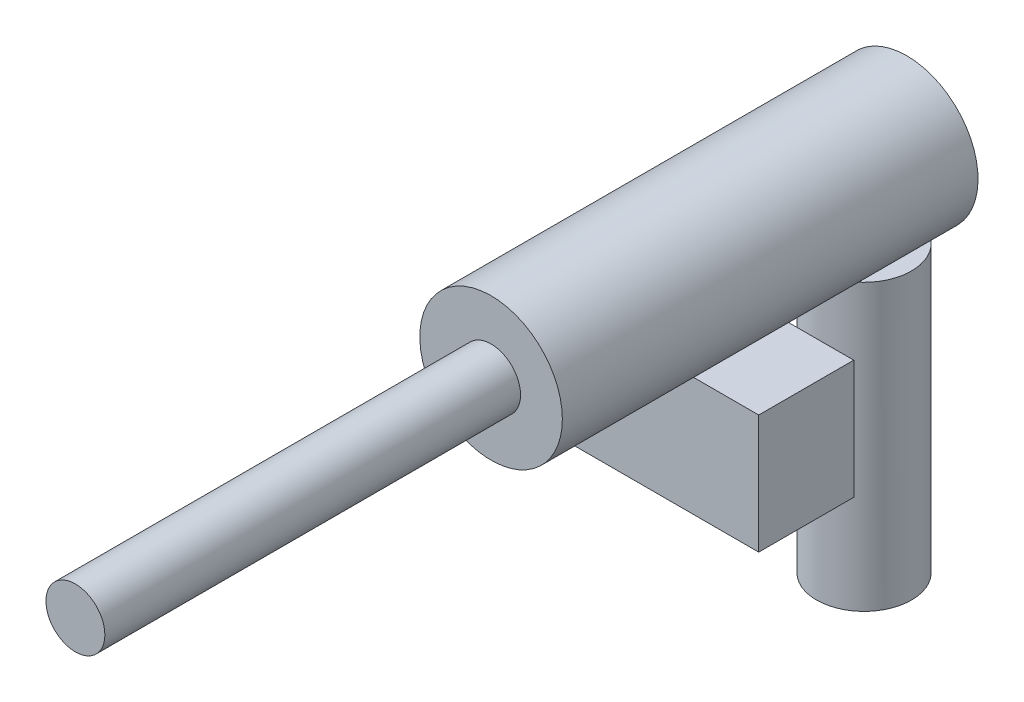
ISO-10303-21;
HEADER;
FILE_DESCRIPTION(('STEP AP214'),'2;1');
FILE_NAME('part.step','',(''),(''),'','','');
FILE_SCHEMA(('AUTOMOTIVE_DESIGN { 1 0 10303 214 1 1 1 1 }'));
ENDSEC;
DATA;
#1=APPLICATION_CONTEXT('core data for automotive mechanical design processes');
#2=APPLICATION_PROTOCOL_DEFINITION('international standard','automotive_design',2000,#1);
#3=PRODUCT_CONTEXT('',#1,'mechanical');
#4=PRODUCT('Part','Part','',(#3));
#5=PRODUCT_RELATED_PRODUCT_CATEGORY('part','',(#4));
#6=PRODUCT_DEFINITION_FORMATION('','',#4);
#7=PRODUCT_DEFINITION_CONTEXT('part definition',#1,'design');
#8=PRODUCT_DEFINITION('design','',#6,#7);
#9=PRODUCT_DEFINITION_SHAPE('','',#8);
#10=(LENGTH_UNIT() NAMED_UNIT(*) SI_UNIT(.MILLI.,.METRE.));
#11=(NAMED_UNIT(*) PLANE_ANGLE_UNIT() SI_UNIT($,.RADIAN.));
#12=(NAMED_UNIT(*) SI_UNIT($,.STERADIAN.) SOLID_ANGLE_UNIT());
#13=UNCERTAINTY_MEASURE_WITH_UNIT(LENGTH_MEASURE(1.E-05),#10,'distance_accuracy_value','');
#14=(GEOMETRIC_REPRESENTATION_CONTEXT(3) GLOBAL_UNCERTAINTY_ASSIGNED_CONTEXT((#13)) GLOBAL_UNIT_ASSIGNED_CONTEXT((#10,
#11,#12)) REPRESENTATION_CONTEXT('',''));
#15=CARTESIAN_POINT('',(0.,0.,0.));
#16=DIRECTION('',(0.,0.,1.));
#17=DIRECTION('',(1.,0.,0.));
#18=AXIS2_PLACEMENT_3D('',#15,#16,#17);
#19=CARTESIAN_POINT('',(0.,120.,17.9882332348629));
#20=DIRECTION('',(0.,-1.,0.));
#21=DIRECTION('',(0.,0.,-1.));
#22=AXIS2_PLACEMENT_3D('',#19,#20,#21);
#23=CYLINDRICAL_SURFACE('',#22,20.);
#24=CARTESIAN_POINT('',(0.,0.,17.9882332348629));
#25=DIRECTION('',(0.,1.,0.));
#26=DIRECTION('',(0.,0.,1.));
#27=AXIS2_PLACEMENT_3D('',#24,#25,#26);
#28=CIRCLE('',#27,20.);
#29=CARTESIAN_POINT('',(0.,0.,37.9882332348629));
#30=VERTEX_POINT('',#29);
#31=EDGE_CURVE('E10',#30,#30,#28,.T.);
#32=ORIENTED_EDGE('',*,*,#31,.T.);
#33=EDGE_LOOP('',(#32));
#34=FACE_BOUND('',#33,.T.);
#35=CARTESIAN_POINT('',(-5.52136853570222,120.,37.2109929090865));
#36=CARTESIAN_POINT('',(-5.29193302138806,119.957037804867,37.2768943103946));
#37=CARTESIAN_POINT('',(-5.06091253678999,119.916554845313,37.3388024333484));
#38=CARTESIAN_POINT('',(-4.59598902122755,119.840737590571,37.45446777266));
#39=CARTESIAN_POINT('',(-4.36208580677417,119.805403624977,37.5082244672428));
#40=CARTESIAN_POINT('',(-3.65650935186531,119.70741580209,37.657012798175));
#41=CARTESIAN_POINT('',(-3.18098714133818,119.652779380687,37.7395575443784));
#42=CARTESIAN_POINT('',(-2.23648701823114,119.567357095238,37.8683503241664));
#43=CARTESIAN_POINT('',(-1.76769162302288,119.535953618657,37.9155387256518));
#44=CARTESIAN_POINT('',(-0.827057573782939,119.495240836377,37.9766799810276));
#45=CARTESIAN_POINT('',(-0.35521962391118,119.485926590303,37.9906402665686));
#46=CARTESIAN_POINT('',(0.569300120255659,119.489514564927,37.9852577339645));
#47=CARTESIAN_POINT('',(1.02199373849562,119.501543628949,37.9672238052882));
#48=CARTESIAN_POINT('',(1.92417509509113,119.545894783714,37.9005962290482));
#49=CARTESIAN_POINT('',(2.37366234055381,119.578219929223,37.8519979812444));
#50=CARTESIAN_POINT('',(3.27874165463818,119.663681644793,37.7230855988506));
#51=CARTESIAN_POINT('',(3.73416545758763,119.717362201779,37.641941952275));
#52=CARTESIAN_POINT('',(4.41014591507066,119.812584102018,37.4973022562262));
#53=CARTESIAN_POINT('',(4.63428007047812,119.8467748898,37.44526835514));
#54=CARTESIAN_POINT('',(5.0798849802044,119.919884182736,37.3337108859222));
#55=CARTESIAN_POINT('',(5.30135588304188,119.958802422903,37.2741877375769));
#56=CARTESIAN_POINT('',(5.52136853570222,120.,37.2109929090865));
#57=B_SPLINE_CURVE_WITH_KNOTS('',3,(#35,#36,#37,#38,#39,#40,#41,#42,#43,#44,#45,#46,#47,#48,#49,
#50,#51,#52,#53,#54,#55,#56),.UNSPECIFIED.,.F.,.F.,(4,2,2,2,2,2,2,2,2,2,4),(0.,
0.727539342602545,1.45512523556238,2.91035344813137,4.32535051133286,5.74003107292183,
7.09816389103249,8.45650117084997,9.85191582673057,10.5496223790287,11.2472898409632),.UNSPECIFIED.);
#58=CARTESIAN_POINT('',(-5.52136853570222,120.,37.2109929090865));
#59=VERTEX_POINT('',#58);
#60=CARTESIAN_POINT('',(5.52136853570222,120.,37.2109929090865));
#61=VERTEX_POINT('',#60);
#62=EDGE_CURVE('E24',#59,#61,#57,.T.);
#63=ORIENTED_EDGE('',*,*,#62,.F.);
#64=CARTESIAN_POINT('',(0.,120.,17.9882332348629));
#65=DIRECTION('',(0.,1.,0.));
#66=DIRECTION('',(0.,0.,1.));
#67=AXIS2_PLACEMENT_3D('',#64,#65,#66);
#68=CIRCLE('',#67,20.);
#69=EDGE_CURVE('E32',#61,#59,#68,.T.);
#70=ORIENTED_EDGE('',*,*,#69,.F.);
#71=EDGE_LOOP('',(#63,#70));
#72=FACE_BOUND('',#71,.T.);
#73=ADVANCED_FACE('F16',(#34,#72),#23,.T.);
#74=CARTESIAN_POINT('',(0.,120.,17.9882332348629));
#75=DIRECTION('',(0.,1.,0.));
#76=DIRECTION('',(0.,0.,1.));
#77=AXIS2_PLACEMENT_3D('',#74,#75,#76);
#78=PLANE('',#77);
#79=DIRECTION('',(1.,0.,0.));
#80=VECTOR('',#79,1.);
#81=CARTESIAN_POINT('',(0.,120.,0.));
#82=LINE('',#81,#80);
#83=CARTESIAN_POINT('',(-5.52136853570222,120.,0.));
#84=VERTEX_POINT('',#83);
#85=CARTESIAN_POINT('',(5.52136853570222,120.,0.));
#86=VERTEX_POINT('',#85);
#87=EDGE_CURVE('E149',#84,#86,#82,.T.);
#88=ORIENTED_EDGE('',*,*,#87,.T.);
#89=DIRECTION('',(0.,0.,-1.));
#90=VECTOR('',#89,1.);
#91=CARTESIAN_POINT('',(5.52136853570222,120.,175.));
#92=LINE('',#91,#90);
#93=EDGE_CURVE('E147',#86,#61,#92,.F.);
#94=ORIENTED_EDGE('',*,*,#93,.T.);
#95=ORIENTED_EDGE('',*,*,#69,.T.);
#96=DIRECTION('',(0.,0.,-1.));
#97=VECTOR('',#96,1.);
#98=CARTESIAN_POINT('',(-5.52136853570222,120.,175.));
#99=LINE('',#98,#97);
#100=EDGE_CURVE('E145',#59,#84,#99,.T.);
#101=ORIENTED_EDGE('',*,*,#100,.T.);
#102=EDGE_LOOP('',(#88,#94,#95,#101));
#103=FACE_BOUND('',#102,.T.);
#104=ADVANCED_FACE('F162',(#103),#78,.T.);
#105=CARTESIAN_POINT('',(0.,0.,17.9882332348629));
#106=DIRECTION('',(0.,1.,0.));
#107=DIRECTION('',(0.,0.,1.));
#108=AXIS2_PLACEMENT_3D('',#105,#106,#107);
#109=PLANE('',#108);
#110=ORIENTED_EDGE('',*,*,#31,.F.);
#111=EDGE_LOOP('',(#110));
#112=FACE_BOUND('',#111,.T.);
#113=ADVANCED_FACE('F160',(#112),#109,.F.);
#114=CARTESIAN_POINT('',(0.,149.48753108507,175.));
#115=DIRECTION('',(0.,0.,-1.));
#116=DIRECTION('',(-1.,0.,0.));
#117=AXIS2_PLACEMENT_3D('',#114,#115,#116);
#118=CYLINDRICAL_SURFACE('',#117,30.);
#119=DIRECTION('',(0.,0.,-1.));
#120=VECTOR('',#119,1.);
#121=CARTESIAN_POINT('',(-3.03737003392138,119.641687433448,175.));
#122=LINE('',#121,#120);
#123=CARTESIAN_POINT('',(-3.03737003392138,119.641687433448,62.3218317474823));
#124=VERTEX_POINT('',#123);
#125=CARTESIAN_POINT('',(-3.03737003392138,119.641687433448,102.321831747482));
#126=VERTEX_POINT('',#125);
#127=EDGE_CURVE('E143',#124,#126,#122,.F.);
#128=ORIENTED_EDGE('',*,*,#127,.T.);
#129=CARTESIAN_POINT('',(0.,149.48753108507,102.321831747482));
#130=DIRECTION('',(0.,0.,1.));
#131=DIRECTION('',(1.,0.,0.));
#132=AXIS2_PLACEMENT_3D('',#129,#130,#131);
#133=CIRCLE('',#132,30.);
#134=CARTESIAN_POINT('',(3.03737003392138,119.641687433448,102.321831747482));
#135=VERTEX_POINT('',#134);
#136=EDGE_CURVE('E141',#126,#135,#133,.T.);
#137=ORIENTED_EDGE('',*,*,#136,.T.);
#138=DIRECTION('',(0.,0.,-1.));
#139=VECTOR('',#138,1.);
#140=CARTESIAN_POINT('',(3.03737003392138,119.641687433448,175.));
#141=LINE('',#140,#139);
#142=CARTESIAN_POINT('',(3.03737003392138,119.641687433448,62.3218317474823));
#143=VERTEX_POINT('',#142);
#144=EDGE_CURVE('E139',#135,#143,#141,.T.);
#145=ORIENTED_EDGE('',*,*,#144,.T.);
#146=CARTESIAN_POINT('',(0.,149.48753108507,62.3218317474823));
#147=DIRECTION('',(0.,0.,-1.));
#148=DIRECTION('',(-1.,0.,0.));
#149=AXIS2_PLACEMENT_3D('',#146,#147,#148);
#150=CIRCLE('',#149,30.);
#151=EDGE_CURVE('E137',#143,#124,#150,.T.);
#152=ORIENTED_EDGE('',*,*,#151,.T.);
#153=EDGE_LOOP('',(#128,#137,#145,#152));
#154=FACE_BOUND('',#153,.T.);
#155=ORIENTED_EDGE('',*,*,#93,.F.);
#156=CARTESIAN_POINT('',(0.,149.48753108507,0.));
#157=DIRECTION('',(0.,0.,1.));
#158=DIRECTION('',(1.,0.,0.));
#159=AXIS2_PLACEMENT_3D('',#156,#157,#158);
#160=CIRCLE('',#159,30.);
#161=EDGE_CURVE('E134',#86,#84,#160,.T.);
#162=ORIENTED_EDGE('',*,*,#161,.T.);
#163=ORIENTED_EDGE('',*,*,#100,.F.);
#164=ORIENTED_EDGE('',*,*,#62,.T.);
#165=EDGE_LOOP('',(#155,#162,#163,#164));
#166=FACE_BOUND('',#165,.T.);
#167=CARTESIAN_POINT('',(0.,149.48753108507,175.));
#168=DIRECTION('',(0.,0.,1.));
#169=DIRECTION('',(1.,0.,0.));
#170=AXIS2_PLACEMENT_3D('',#167,#168,#169);
#171=CIRCLE('',#170,30.);
#172=CARTESIAN_POINT('',(30.,149.48753108507,175.));
#173=VERTEX_POINT('',#172);
#174=EDGE_CURVE('E131',#173,#173,#171,.T.);
#175=ORIENTED_EDGE('',*,*,#174,.F.);
#176=EDGE_LOOP('',(#175));
#177=FACE_BOUND('',#176,.T.);
#178=ADVANCED_FACE('F155',(#154,#166,#177),#118,.T.);
#179=CARTESIAN_POINT('',(0.,149.48753108507,175.));
#180=DIRECTION('',(0.,0.,1.));
#181=DIRECTION('',(1.,0.,0.));
#182=AXIS2_PLACEMENT_3D('',#179,#180,#181);
#183=PLANE('',#182);
#184=CARTESIAN_POINT('',(0.,149.48753108507,175.));
#185=DIRECTION('',(0.,0.,1.));
#186=DIRECTION('',(1.,0.,0.));
#187=AXIS2_PLACEMENT_3D('',#184,#185,#186);
#188=CIRCLE('',#187,12.4009204125942);
#189=CARTESIAN_POINT('',(12.4009204125942,149.48753108507,175.));
#190=VERTEX_POINT('',#189);
#191=EDGE_CURVE('E128',#190,#190,#188,.T.);
#192=ORIENTED_EDGE('',*,*,#191,.F.);
#193=EDGE_LOOP('',(#192));
#194=FACE_BOUND('',#193,.T.);
#195=ORIENTED_EDGE('',*,*,#174,.T.);
#196=EDGE_LOOP('',(#195));
#197=FACE_BOUND('',#196,.T.);
#198=ADVANCED_FACE('F159',(#194,#197),#183,.T.);
#199=CARTESIAN_POINT('',(0.,149.48753108507,0.));
#200=DIRECTION('',(0.,0.,1.));
#201=DIRECTION('',(1.,0.,0.));
#202=AXIS2_PLACEMENT_3D('',#199,#200,#201);
#203=PLANE('',#202);
#204=ORIENTED_EDGE('',*,*,#87,.F.);
#205=ORIENTED_EDGE('',*,*,#161,.F.);
#206=EDGE_LOOP('',(#204,#205));
#207=FACE_BOUND('',#206,.T.);
#208=ADVANCED_FACE('F171',(#207),#203,.F.);
#209=CARTESIAN_POINT('',(0.,149.48753108507,350.));
#210=DIRECTION('',(0.,0.,-1.));
#211=DIRECTION('',(-1.,0.,0.));
#212=AXIS2_PLACEMENT_3D('',#209,#210,#211);
#213=CYLINDRICAL_SURFACE('',#212,12.4009204125942);
#214=CARTESIAN_POINT('',(0.,149.48753108507,350.));
#215=DIRECTION('',(0.,0.,1.));
#216=DIRECTION('',(1.,0.,0.));
#217=AXIS2_PLACEMENT_3D('',#214,#215,#216);
#218=CIRCLE('',#217,12.4009204125942);
#219=CARTESIAN_POINT('',(12.4009204125942,149.48753108507,350.));
#220=VERTEX_POINT('',#219);
#221=EDGE_CURVE('E125',#220,#220,#218,.T.);
#222=ORIENTED_EDGE('',*,*,#221,.F.);
#223=EDGE_LOOP('',(#222));
#224=FACE_BOUND('',#223,.T.);
#225=ORIENTED_EDGE('',*,*,#191,.T.);
#226=EDGE_LOOP('',(#225));
#227=FACE_BOUND('',#226,.T.);
#228=ADVANCED_FACE('F175',(#224,#227),#213,.T.);
#229=CARTESIAN_POINT('',(0.,149.48753108507,350.));
#230=DIRECTION('',(0.,0.,1.));
#231=DIRECTION('',(1.,0.,0.));
#232=AXIS2_PLACEMENT_3D('',#229,#230,#231);
#233=PLANE('',#232);
#234=ORIENTED_EDGE('',*,*,#221,.T.);
#235=EDGE_LOOP('',(#234));
#236=FACE_BOUND('',#235,.T.);
#237=ADVANCED_FACE('F179',(#236),#233,.T.);
#238=CARTESIAN_POINT('',(-40.,119.641687433448,102.321831747482));
#239=DIRECTION('',(0.,1.,0.));
#240=DIRECTION('',(0.,0.,1.));
#241=AXIS2_PLACEMENT_3D('',#238,#239,#240);
#242=PLANE('',#241);
#243=ORIENTED_EDGE('',*,*,#144,.F.);
#244=DIRECTION('',(1.,0.,0.));
#245=VECTOR('',#244,1.);
#246=CARTESIAN_POINT('',(-40.,119.641687433448,102.321831747482));
#247=LINE('',#246,#245);
#248=CARTESIAN_POINT('',(40.,119.641687433448,102.321831747482));
#249=VERTEX_POINT('',#248);
#250=EDGE_CURVE('E122',#135,#249,#247,.T.);
#251=ORIENTED_EDGE('',*,*,#250,.T.);
#252=DIRECTION('',(0.,0.,1.));
#253=VECTOR('',#252,1.);
#254=CARTESIAN_POINT('',(40.,119.641687433448,102.321831747482));
#255=LINE('',#254,#253);
#256=CARTESIAN_POINT('',(40.,119.641687433448,62.3218317474823));
#257=VERTEX_POINT('',#256);
#258=EDGE_CURVE('E119',#257,#249,#255,.T.);
#259=ORIENTED_EDGE('',*,*,#258,.F.);
#260=DIRECTION('',(1.,0.,0.));
#261=VECTOR('',#260,1.);
#262=CARTESIAN_POINT('',(-40.,119.641687433448,62.3218317474823));
#263=LINE('',#262,#261);
#264=EDGE_CURVE('E118',#143,#257,#263,.T.);
#265=ORIENTED_EDGE('',*,*,#264,.F.);
#266=EDGE_LOOP('',(#243,#251,#259,#265));
#267=FACE_BOUND('',#266,.T.);
#268=ADVANCED_FACE('F183',(#267),#242,.T.);
#269=ORIENTED_EDGE('',*,*,#127,.F.);
#270=CARTESIAN_POINT('',(-40.,119.641687433448,62.3218317474823));
#271=VERTEX_POINT('',#270);
#272=EDGE_CURVE('E116',#271,#124,#263,.T.);
#273=ORIENTED_EDGE('',*,*,#272,.F.);
#274=DIRECTION('',(0.,0.,1.));
#275=VECTOR('',#274,1.);
#276=CARTESIAN_POINT('',(-40.,119.641687433448,102.321831747482));
#277=LINE('',#276,#275);
#278=CARTESIAN_POINT('',(-40.,119.641687433448,102.321831747482));
#279=VERTEX_POINT('',#278);
#280=EDGE_CURVE('E103',#271,#279,#277,.T.);
#281=ORIENTED_EDGE('',*,*,#280,.T.);
#282=EDGE_CURVE('E114',#279,#126,#247,.T.);
#283=ORIENTED_EDGE('',*,*,#282,.T.);
#284=EDGE_LOOP('',(#269,#273,#281,#283));
#285=FACE_BOUND('',#284,.T.);
#286=ADVANCED_FACE('F185',(#285),#242,.T.);
#287=CARTESIAN_POINT('',(-40.,119.641687433448,102.321831747482));
#288=DIRECTION('',(0.,0.,1.));
#289=DIRECTION('',(1.,0.,0.));
#290=AXIS2_PLACEMENT_3D('',#287,#288,#289);
#291=PLANE('',#290);
#292=ORIENTED_EDGE('',*,*,#136,.F.);
#293=ORIENTED_EDGE('',*,*,#282,.F.);
#294=DIRECTION('',(0.,-1.,0.));
#295=VECTOR('',#294,1.);
#296=CARTESIAN_POINT('',(-40.,119.641687433448,102.321831747482));
#297=LINE('',#296,#295);
#298=CARTESIAN_POINT('',(-40.,69.6416874334483,102.321831747482));
#299=VERTEX_POINT('',#298);
#300=EDGE_CURVE('E112',#279,#299,#297,.T.);
#301=ORIENTED_EDGE('',*,*,#300,.T.);
#302=DIRECTION('',(1.,0.,0.));
#303=VECTOR('',#302,1.);
#304=CARTESIAN_POINT('',(-40.,69.6416874334483,102.321831747482));
#305=LINE('',#304,#303);
#306=CARTESIAN_POINT('',(40.,69.6416874334483,102.321831747482));
#307=VERTEX_POINT('',#306);
#308=EDGE_CURVE('E97',#299,#307,#305,.T.);
#309=ORIENTED_EDGE('',*,*,#308,.T.);
#310=DIRECTION('',(0.,-1.,0.));
#311=VECTOR('',#310,1.);
#312=CARTESIAN_POINT('',(40.,119.641687433448,102.321831747482));
#313=LINE('',#312,#311);
#314=EDGE_CURVE('E108',#249,#307,#313,.T.);
#315=ORIENTED_EDGE('',*,*,#314,.F.);
#316=ORIENTED_EDGE('',*,*,#250,.F.);
#317=EDGE_LOOP('',(#292,#293,#301,#309,#315,#316));
#318=FACE_BOUND('',#317,.T.);
#319=ADVANCED_FACE('F188',(#318),#291,.T.);
#320=CARTESIAN_POINT('',(-40.,119.641687433448,62.3218317474823));
#321=DIRECTION('',(0.,0.,-1.));
#322=DIRECTION('',(-1.,0.,0.));
#323=AXIS2_PLACEMENT_3D('',#320,#321,#322);
#324=PLANE('',#323);
#325=ORIENTED_EDGE('',*,*,#151,.F.);
#326=ORIENTED_EDGE('',*,*,#264,.T.);
#327=DIRECTION('',(0.,1.,0.));
#328=VECTOR('',#327,1.);
#329=CARTESIAN_POINT('',(40.,119.641687433448,62.3218317474823));
#330=LINE('',#329,#328);
#331=CARTESIAN_POINT('',(40.,69.6416874334483,62.3218317474823));
#332=VERTEX_POINT('',#331);
#333=EDGE_CURVE('E88',#332,#257,#330,.T.);
#334=ORIENTED_EDGE('',*,*,#333,.F.);
#335=DIRECTION('',(1.,0.,0.));
#336=VECTOR('',#335,1.);
#337=CARTESIAN_POINT('',(-40.,69.6416874334483,62.3218317474823));
#338=LINE('',#337,#336);
#339=CARTESIAN_POINT('',(-40.,69.6416874334483,62.3218317474823));
#340=VERTEX_POINT('',#339);
#341=EDGE_CURVE('E78',#340,#332,#338,.T.);
#342=ORIENTED_EDGE('',*,*,#341,.F.);
#343=DIRECTION('',(0.,1.,0.));
#344=VECTOR('',#343,1.);
#345=CARTESIAN_POINT('',(-40.,119.641687433448,62.3218317474823));
#346=LINE('',#345,#344);
#347=EDGE_CURVE('E84',#340,#271,#346,.T.);
#348=ORIENTED_EDGE('',*,*,#347,.T.);
#349=ORIENTED_EDGE('',*,*,#272,.T.);
#350=EDGE_LOOP('',(#325,#326,#334,#342,#348,#349));
#351=FACE_BOUND('',#350,.T.);
#352=ADVANCED_FACE('F81',(#351),#324,.T.);
#353=CARTESIAN_POINT('',(-40.,69.6416874334483,102.321831747482));
#354=DIRECTION('',(0.,-1.,0.));
#355=DIRECTION('',(0.,0.,-1.));
#356=AXIS2_PLACEMENT_3D('',#353,#354,#355);
#357=PLANE('',#356);
#358=ORIENTED_EDGE('',*,*,#341,.T.);
#359=DIRECTION('',(0.,0.,-1.));
#360=VECTOR('',#359,1.);
#361=CARTESIAN_POINT('',(40.,69.6416874334483,102.321831747482));
#362=LINE('',#361,#360);
#363=EDGE_CURVE('E100',#307,#332,#362,.T.);
#364=ORIENTED_EDGE('',*,*,#363,.F.);
#365=ORIENTED_EDGE('',*,*,#308,.F.);
#366=DIRECTION('',(0.,0.,-1.));
#367=VECTOR('',#366,1.);
#368=CARTESIAN_POINT('',(-40.,69.6416874334483,102.321831747482));
#369=LINE('',#368,#367);
#370=EDGE_CURVE('E95',#299,#340,#369,.T.);
#371=ORIENTED_EDGE('',*,*,#370,.T.);
#372=EDGE_LOOP('',(#358,#364,#365,#371));
#373=FACE_BOUND('',#372,.T.);
#374=ADVANCED_FACE('F96',(#373),#357,.T.);
#375=CARTESIAN_POINT('',(-40.,0.,0.));
#376=DIRECTION('',(1.,0.,0.));
#377=DIRECTION('',(0.,0.,-1.));
#378=AXIS2_PLACEMENT_3D('',#375,#376,#377);
#379=PLANE('',#378);
#380=ORIENTED_EDGE('',*,*,#300,.F.);
#381=ORIENTED_EDGE('',*,*,#280,.F.);
#382=ORIENTED_EDGE('',*,*,#347,.F.);
#383=ORIENTED_EDGE('',*,*,#370,.F.);
#384=EDGE_LOOP('',(#380,#381,#382,#383));
#385=FACE_BOUND('',#384,.T.);
#386=ADVANCED_FACE('F102',(#385),#379,.F.);
#387=CARTESIAN_POINT('',(40.,0.,0.));
#388=DIRECTION('',(1.,0.,0.));
#389=DIRECTION('',(0.,0.,-1.));
#390=AXIS2_PLACEMENT_3D('',#387,#388,#389);
#391=PLANE('',#390);
#392=ORIENTED_EDGE('',*,*,#314,.T.);
#393=ORIENTED_EDGE('',*,*,#363,.T.);
#394=ORIENTED_EDGE('',*,*,#333,.T.);
#395=ORIENTED_EDGE('',*,*,#258,.T.);
#396=EDGE_LOOP('',(#392,#393,#394,#395));
#397=FACE_BOUND('',#396,.T.);
#398=ADVANCED_FACE('F199',(#397),#391,.T.);
#399=CLOSED_SHELL('',(#73,#104,#113,#178,#198,#208,#228,#237,#268,#286,#319,#352,#374,#386,#398));
#400=MANIFOLD_SOLID_BREP('B1',#399);
#401=ADVANCED_BREP_SHAPE_REPRESENTATION('',(#18,#400),#14);
#402=SHAPE_DEFINITION_REPRESENTATION(#9,#401);
ENDSEC;
END-ISO-10303-21;
